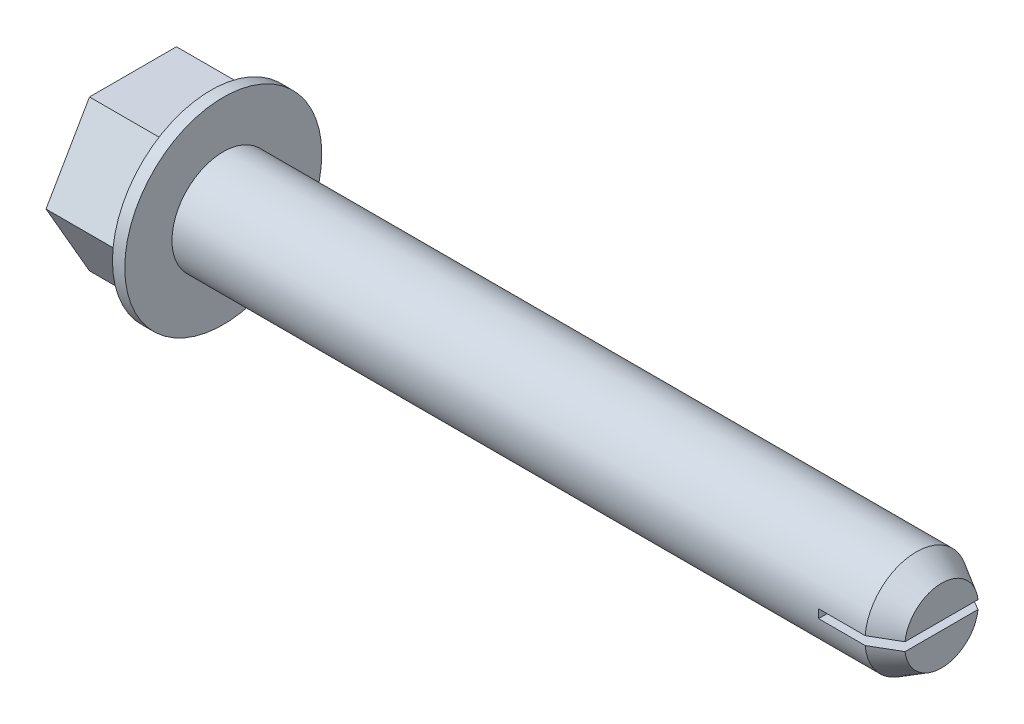
ISO-10303-21;
HEADER;
FILE_DESCRIPTION(('STEP AP214'),'2;1');
FILE_NAME('part.step','',(''),(''),'','','');
FILE_SCHEMA(('AUTOMOTIVE_DESIGN { 1 0 10303 214 1 1 1 1 }'));
ENDSEC;
DATA;
#1=APPLICATION_CONTEXT('core data for automotive mechanical design processes');
#2=APPLICATION_PROTOCOL_DEFINITION('international standard','automotive_design',2000,#1);
#3=PRODUCT_CONTEXT('',#1,'mechanical');
#4=PRODUCT('Part','Part','',(#3));
#5=PRODUCT_RELATED_PRODUCT_CATEGORY('part','',(#4));
#6=PRODUCT_DEFINITION_FORMATION('','',#4);
#7=PRODUCT_DEFINITION_CONTEXT('part definition',#1,'design');
#8=PRODUCT_DEFINITION('design','',#6,#7);
#9=PRODUCT_DEFINITION_SHAPE('','',#8);
#10=(LENGTH_UNIT() NAMED_UNIT(*) SI_UNIT(.MILLI.,.METRE.));
#11=(NAMED_UNIT(*) PLANE_ANGLE_UNIT() SI_UNIT($,.RADIAN.));
#12=(NAMED_UNIT(*) SI_UNIT($,.STERADIAN.) SOLID_ANGLE_UNIT());
#13=UNCERTAINTY_MEASURE_WITH_UNIT(LENGTH_MEASURE(1.E-05),#10,'distance_accuracy_value','');
#14=(GEOMETRIC_REPRESENTATION_CONTEXT(3) GLOBAL_UNCERTAINTY_ASSIGNED_CONTEXT((#13)) GLOBAL_UNIT_ASSIGNED_CONTEXT((#10,
#11,#12)) REPRESENTATION_CONTEXT('',''));
#15=CARTESIAN_POINT('',(0.,0.,0.));
#16=DIRECTION('',(0.,0.,1.));
#17=DIRECTION('',(1.,0.,0.));
#18=AXIS2_PLACEMENT_3D('',#15,#16,#17);
#19=CARTESIAN_POINT('',(-4.6228,3.72872,0.));
#20=DIRECTION('',(1.,0.,0.));
#21=DIRECTION('',(0.,0.,-1.));
#22=AXIS2_PLACEMENT_3D('',#19,#20,#21);
#23=PLANE('',#22);
#24=CARTESIAN_POINT('',(-4.6228,0.,0.));
#25=DIRECTION('',(-1.,0.,0.));
#26=DIRECTION('',(0.,0.,1.));
#27=AXIS2_PLACEMENT_3D('',#24,#25,#26);
#28=CIRCLE('',#27,3.72872);
#29=CARTESIAN_POINT('',(-4.6228,0.,3.72872));
#30=VERTEX_POINT('',#29);
#31=EDGE_CURVE('E20',#30,#30,#28,.T.);
#32=ORIENTED_EDGE('',*,*,#31,.T.);
#33=EDGE_LOOP('',(#32));
#34=FACE_BOUND('',#33,.T.);
#35=ADVANCED_FACE('F17',(#34),#23,.F.);
#36=CARTESIAN_POINT('',(0.,0.,0.));
#37=DIRECTION('',(-1.,0.,0.));
#38=DIRECTION('',(0.,0.,1.));
#39=AXIS2_PLACEMENT_3D('',#36,#37,#38);
#40=CYLINDRICAL_SURFACE('',#39,3.72872);
#41=ORIENTED_EDGE('',*,*,#31,.F.);
#42=EDGE_LOOP('',(#41));
#43=FACE_BOUND('',#42,.T.);
#44=CARTESIAN_POINT('',(-5.588,0.,0.));
#45=DIRECTION('',(-1.,0.,0.));
#46=DIRECTION('',(0.,0.,1.));
#47=AXIS2_PLACEMENT_3D('',#44,#45,#46);
#48=CIRCLE('',#47,3.72872);
#49=CARTESIAN_POINT('',(-5.588,0.,3.72872));
#50=VERTEX_POINT('',#49);
#51=EDGE_CURVE('E125',#50,#50,#48,.T.);
#52=ORIENTED_EDGE('',*,*,#51,.T.);
#53=EDGE_LOOP('',(#52));
#54=FACE_BOUND('',#53,.T.);
#55=ADVANCED_FACE('F212',(#43,#54),#40,.F.);
#56=CARTESIAN_POINT('',(-5.588,4.6609,0.));
#57=DIRECTION('',(1.,0.,0.));
#58=DIRECTION('',(0.,0.,-1.));
#59=AXIS2_PLACEMENT_3D('',#56,#57,#58);
#60=PLANE('',#59);
#61=DIRECTION('',(0.,0.,-1.));
#62=VECTOR('',#61,1.);
#63=CARTESIAN_POINT('',(-5.58799999998882,-4.6609,0.));
#64=LINE('',#63,#62);
#65=CARTESIAN_POINT('',(-5.58800000007968,-4.6609,2.69097186966593));
#66=VERTEX_POINT('',#65);
#67=CARTESIAN_POINT('',(-5.58799999999441,-4.6609,-2.69097186966593));
#68=VERTEX_POINT('',#67);
#69=EDGE_CURVE('E122',#66,#68,#64,.T.);
#70=ORIENTED_EDGE('',*,*,#69,.F.);
#71=DIRECTION('',(0.,-0.866025403784439,-0.5));
#72=VECTOR('',#71,1.);
#73=CARTESIAN_POINT('',(-5.5880000002162,-2.33045,4.03645780449889));
#74=LINE('',#73,#72);
#75=CARTESIAN_POINT('',(-5.58800000007968,0.,5.38194373933185));
#76=VERTEX_POINT('',#75);
#77=EDGE_CURVE('E117',#76,#66,#74,.T.);
#78=ORIENTED_EDGE('',*,*,#77,.F.);
#79=DIRECTION('',(0.,-0.866025403784439,0.5));
#80=VECTOR('',#79,1.);
#81=CARTESIAN_POINT('',(-5.58799999998882,2.33045,4.03645780449889));
#82=LINE('',#81,#80);
#83=CARTESIAN_POINT('',(-5.58799999999441,4.6609,2.69097186966593));
#84=VERTEX_POINT('',#83);
#85=EDGE_CURVE('E114',#84,#76,#82,.T.);
#86=ORIENTED_EDGE('',*,*,#85,.F.);
#87=DIRECTION('',(0.,0.,1.));
#88=VECTOR('',#87,1.);
#89=CARTESIAN_POINT('',(-5.58799999998882,4.6609,0.));
#90=LINE('',#89,#88);
#91=CARTESIAN_POINT('',(-5.58800000007968,4.6609,-2.69097186966593));
#92=VERTEX_POINT('',#91);
#93=EDGE_CURVE('E134',#92,#84,#90,.T.);
#94=ORIENTED_EDGE('',*,*,#93,.F.);
#95=DIRECTION('',(0.,0.866025403784439,0.5));
#96=VECTOR('',#95,1.);
#97=CARTESIAN_POINT('',(-5.5880000002162,2.33045,-4.03645780449889));
#98=LINE('',#97,#96);
#99=CARTESIAN_POINT('',(-5.58800000016215,0.,-5.38194373933185));
#100=VERTEX_POINT('',#99);
#101=EDGE_CURVE('E280',#100,#92,#98,.T.);
#102=ORIENTED_EDGE('',*,*,#101,.F.);
#103=DIRECTION('',(0.,0.866025403784439,-0.5));
#104=VECTOR('',#103,1.);
#105=CARTESIAN_POINT('',(-5.58799999998882,-2.33045,-4.03645780449889));
#106=LINE('',#105,#104);
#107=EDGE_CURVE('E272',#68,#100,#106,.T.);
#108=ORIENTED_EDGE('',*,*,#107,.F.);
#109=EDGE_LOOP('',(#70,#78,#86,#94,#102,#108));
#110=FACE_BOUND('',#109,.T.);
#111=ORIENTED_EDGE('',*,*,#51,.F.);
#112=EDGE_LOOP('',(#111));
#113=FACE_BOUND('',#112,.T.);
#114=ADVANCED_FACE('F119',(#110,#113),#60,.F.);
#115=CARTESIAN_POINT('',(500000.,-2.33045,4.03645780449889));
#116=DIRECTION('',(0.,-0.5,0.866025403784439));
#117=DIRECTION('',(0.,-0.866025403784439,-0.5));
#118=AXIS2_PLACEMENT_3D('',#115,#116,#117);
#119=PLANE('',#118);
#120=DIRECTION('',(0.,0.866025403784439,0.5));
#121=VECTOR('',#120,1.);
#122=CARTESIAN_POINT('',(-0.762,-4.6609,2.69097186966593));
#123=LINE('',#122,#121);
#124=CARTESIAN_POINT('',(-0.762000000091873,-4.6609,2.69097186966593));
#125=VERTEX_POINT('',#124);
#126=CARTESIAN_POINT('',(-0.762000000177139,0.,5.38194373933185));
#127=VERTEX_POINT('',#126);
#128=EDGE_CURVE('E131',#125,#127,#123,.T.);
#129=ORIENTED_EDGE('',*,*,#128,.T.);
#130=DIRECTION('',(1.,0.,0.));
#131=VECTOR('',#130,1.);
#132=CARTESIAN_POINT('',(500000.,0.,5.38194373933185));
#133=LINE('',#132,#131);
#134=EDGE_CURVE('E128',#76,#127,#133,.T.);
#135=ORIENTED_EDGE('',*,*,#134,.F.);
#136=ORIENTED_EDGE('',*,*,#77,.T.);
#137=DIRECTION('',(1.,0.,0.));
#138=VECTOR('',#137,1.);
#139=CARTESIAN_POINT('',(500000.,-4.6609,2.69097186966593));
#140=LINE('',#139,#138);
#141=EDGE_CURVE('E267',#125,#66,#140,.F.);
#142=ORIENTED_EDGE('',*,*,#141,.F.);
#143=EDGE_LOOP('',(#129,#135,#136,#142));
#144=FACE_BOUND('',#143,.T.);
#145=ADVANCED_FACE('F129',(#144),#119,.T.);
#146=CARTESIAN_POINT('',(500000.,2.33045,4.03645780449889));
#147=DIRECTION('',(0.,0.5,0.866025403784439));
#148=DIRECTION('',(0.,-0.866025403784439,0.5));
#149=AXIS2_PLACEMENT_3D('',#146,#147,#148);
#150=PLANE('',#149);
#151=DIRECTION('',(0.,0.866025403784439,-0.5));
#152=VECTOR('',#151,1.);
#153=CARTESIAN_POINT('',(-0.762,0.,5.38194373933185));
#154=LINE('',#153,#152);
#155=CARTESIAN_POINT('',(-0.762000000006608,4.6609,2.69097186966593));
#156=VERTEX_POINT('',#155);
#157=EDGE_CURVE('E264',#127,#156,#154,.T.);
#158=ORIENTED_EDGE('',*,*,#157,.T.);
#159=DIRECTION('',(1.,0.,0.));
#160=VECTOR('',#159,1.);
#161=CARTESIAN_POINT('',(500000.,4.6609,2.69097186966593));
#162=LINE('',#161,#160);
#163=EDGE_CURVE('E138',#84,#156,#162,.T.);
#164=ORIENTED_EDGE('',*,*,#163,.F.);
#165=ORIENTED_EDGE('',*,*,#85,.T.);
#166=ORIENTED_EDGE('',*,*,#134,.T.);
#167=EDGE_LOOP('',(#158,#164,#165,#166));
#168=FACE_BOUND('',#167,.T.);
#169=ADVANCED_FACE('F136',(#168),#150,.T.);
#170=CARTESIAN_POINT('',(500000.,4.6609,0.));
#171=DIRECTION('',(0.,1.,0.));
#172=DIRECTION('',(0.,0.,1.));
#173=AXIS2_PLACEMENT_3D('',#170,#171,#172);
#174=PLANE('',#173);
#175=DIRECTION('',(0.,0.,-1.));
#176=VECTOR('',#175,1.);
#177=CARTESIAN_POINT('',(-0.762,4.6609,0.));
#178=LINE('',#177,#176);
#179=CARTESIAN_POINT('',(-0.762000000049241,4.6609,-2.69097186966593));
#180=VERTEX_POINT('',#179);
#181=EDGE_CURVE('E262',#156,#180,#178,.T.);
#182=ORIENTED_EDGE('',*,*,#181,.T.);
#183=DIRECTION('',(1.,0.,0.));
#184=VECTOR('',#183,1.);
#185=CARTESIAN_POINT('',(500000.,4.6609,-2.69097186966593));
#186=LINE('',#185,#184);
#187=EDGE_CURVE('E277',#92,#180,#186,.T.);
#188=ORIENTED_EDGE('',*,*,#187,.F.);
#189=ORIENTED_EDGE('',*,*,#93,.T.);
#190=ORIENTED_EDGE('',*,*,#163,.T.);
#191=EDGE_LOOP('',(#182,#188,#189,#190));
#192=FACE_BOUND('',#191,.T.);
#193=ADVANCED_FACE('F285',(#192),#174,.T.);
#194=CARTESIAN_POINT('',(500000.,2.33045,-4.03645780449889));
#195=DIRECTION('',(0.,0.5,-0.866025403784439));
#196=DIRECTION('',(0.,0.866025403784439,0.5));
#197=AXIS2_PLACEMENT_3D('',#194,#195,#196);
#198=PLANE('',#197);
#199=DIRECTION('',(0.,-0.866025403784439,-0.5));
#200=VECTOR('',#199,1.);
#201=CARTESIAN_POINT('',(-0.762,4.6609,-2.69097186966593));
#202=LINE('',#201,#200);
#203=CARTESIAN_POINT('',(-0.762000000148717,0.,-5.38194373933185));
#204=VERTEX_POINT('',#203);
#205=EDGE_CURVE('E260',#180,#204,#202,.T.);
#206=ORIENTED_EDGE('',*,*,#205,.T.);
#207=DIRECTION('',(1.,0.,0.));
#208=VECTOR('',#207,1.);
#209=CARTESIAN_POINT('',(500000.,0.,-5.38194373933185));
#210=LINE('',#209,#208);
#211=EDGE_CURVE('E275',#100,#204,#210,.T.);
#212=ORIENTED_EDGE('',*,*,#211,.F.);
#213=ORIENTED_EDGE('',*,*,#101,.T.);
#214=ORIENTED_EDGE('',*,*,#187,.T.);
#215=EDGE_LOOP('',(#206,#212,#213,#214));
#216=FACE_BOUND('',#215,.T.);
#217=ADVANCED_FACE('F289',(#216),#198,.T.);
#218=CARTESIAN_POINT('',(500000.,-2.33045,-4.03645780449889));
#219=DIRECTION('',(0.,-0.5,-0.866025403784439));
#220=DIRECTION('',(0.,0.866025403784439,-0.5));
#221=AXIS2_PLACEMENT_3D('',#218,#219,#220);
#222=PLANE('',#221);
#223=DIRECTION('',(1.,0.,0.));
#224=VECTOR('',#223,1.);
#225=CARTESIAN_POINT('',(500000.,-4.6609,-2.69097186966593));
#226=LINE('',#225,#224);
#227=CARTESIAN_POINT('',(-0.761999999949765,-4.6609,-2.69097186966593));
#228=VERTEX_POINT('',#227);
#229=EDGE_CURVE('E269',#68,#228,#226,.T.);
#230=ORIENTED_EDGE('',*,*,#229,.F.);
#231=ORIENTED_EDGE('',*,*,#107,.T.);
#232=ORIENTED_EDGE('',*,*,#211,.T.);
#233=DIRECTION('',(0.,-0.866025403784439,0.5));
#234=VECTOR('',#233,1.);
#235=CARTESIAN_POINT('',(-0.762,0.,-5.38194373933185));
#236=LINE('',#235,#234);
#237=EDGE_CURVE('E81',#204,#228,#236,.T.);
#238=ORIENTED_EDGE('',*,*,#237,.T.);
#239=EDGE_LOOP('',(#230,#231,#232,#238));
#240=FACE_BOUND('',#239,.T.);
#241=ADVANCED_FACE('F291',(#240),#222,.T.);
#242=CARTESIAN_POINT('',(500000.,-4.6609,0.));
#243=DIRECTION('',(0.,-1.,0.));
#244=DIRECTION('',(0.,0.,-1.));
#245=AXIS2_PLACEMENT_3D('',#242,#243,#244);
#246=PLANE('',#245);
#247=DIRECTION('',(0.,0.,-1.));
#248=VECTOR('',#247,1.);
#249=CARTESIAN_POINT('',(-0.762,-4.6609,0.));
#250=LINE('',#249,#248);
#251=EDGE_CURVE('E204',#228,#125,#250,.F.);
#252=ORIENTED_EDGE('',*,*,#251,.T.);
#253=ORIENTED_EDGE('',*,*,#141,.T.);
#254=ORIENTED_EDGE('',*,*,#69,.T.);
#255=ORIENTED_EDGE('',*,*,#229,.T.);
#256=EDGE_LOOP('',(#252,#253,#254,#255));
#257=FACE_BOUND('',#256,.T.);
#258=ADVANCED_FACE('F294',(#257),#246,.T.);
#259=CARTESIAN_POINT('',(-0.762,6.096,0.));
#260=DIRECTION('',(1.,0.,0.));
#261=DIRECTION('',(0.,0.,-1.));
#262=AXIS2_PLACEMENT_3D('',#259,#260,#261);
#263=PLANE('',#262);
#264=CARTESIAN_POINT('',(-0.762,0.,0.));
#265=DIRECTION('',(-1.,0.,0.));
#266=DIRECTION('',(0.,0.,1.));
#267=AXIS2_PLACEMENT_3D('',#264,#265,#266);
#268=CIRCLE('',#267,6.096);
#269=CARTESIAN_POINT('',(-0.762,0.,6.096));
#270=VERTEX_POINT('',#269);
#271=EDGE_CURVE('E202',#270,#270,#268,.F.);
#272=ORIENTED_EDGE('',*,*,#271,.F.);
#273=EDGE_LOOP('',(#272));
#274=FACE_BOUND('',#273,.T.);
#275=ORIENTED_EDGE('',*,*,#237,.F.);
#276=ORIENTED_EDGE('',*,*,#205,.F.);
#277=ORIENTED_EDGE('',*,*,#181,.F.);
#278=ORIENTED_EDGE('',*,*,#157,.F.);
#279=ORIENTED_EDGE('',*,*,#128,.F.);
#280=ORIENTED_EDGE('',*,*,#251,.F.);
#281=EDGE_LOOP('',(#275,#276,#277,#278,#279,#280));
#282=FACE_BOUND('',#281,.T.);
#283=ADVANCED_FACE('F296',(#274,#282),#263,.F.);
#284=CARTESIAN_POINT('',(44.45,3.175,0.));
#285=DIRECTION('',(-1.,0.,0.));
#286=DIRECTION('',(0.,0.,1.));
#287=AXIS2_PLACEMENT_3D('',#284,#285,#286);
#288=PLANE('',#287);
#289=DIRECTION('',(0.,0.,-1.));
#290=VECTOR('',#289,1.);
#291=CARTESIAN_POINT('',(44.45,-0.264583333333333,-6.096));
#292=LINE('',#291,#290);
#293=CARTESIAN_POINT('',(44.449999999988,-0.264583333333333,-2.25785042677769));
#294=VERTEX_POINT('',#293);
#295=CARTESIAN_POINT('',(44.4499999999917,-0.264583333333333,2.25785042677553));
#296=VERTEX_POINT('',#295);
#297=EDGE_CURVE('E200',#294,#296,#292,.F.);
#298=ORIENTED_EDGE('',*,*,#297,.T.);
#299=CARTESIAN_POINT('',(44.4499999999834,0.,0.));
#300=DIRECTION('',(-1.,0.,0.));
#301=DIRECTION('',(0.,0.,1.));
#302=AXIS2_PLACEMENT_3D('',#299,#300,#301);
#303=CIRCLE('',#302,2.27329999999779);
#304=EDGE_CURVE('E72',#294,#296,#303,.T.);
#305=ORIENTED_EDGE('',*,*,#304,.F.);
#306=EDGE_LOOP('',(#298,#305));
#307=FACE_BOUND('',#306,.T.);
#308=ADVANCED_FACE('F298',(#307),#288,.F.);
#309=CARTESIAN_POINT('',(0.,0.,0.));
#310=DIRECTION('',(-1.,0.,0.));
#311=DIRECTION('',(0.,0.,1.));
#312=AXIS2_PLACEMENT_3D('',#309,#310,#311);
#313=CYLINDRICAL_SURFACE('',#312,6.096);
#314=ORIENTED_EDGE('',*,*,#271,.T.);
#315=EDGE_LOOP('',(#314));
#316=FACE_BOUND('',#315,.T.);
#317=CARTESIAN_POINT('',(0.,0.,0.));
#318=DIRECTION('',(-1.,0.,0.));
#319=DIRECTION('',(0.,0.,1.));
#320=AXIS2_PLACEMENT_3D('',#317,#318,#319);
#321=CIRCLE('',#320,6.096);
#322=CARTESIAN_POINT('',(0.,0.,6.096));
#323=VERTEX_POINT('',#322);
#324=EDGE_CURVE('E240',#323,#323,#321,.T.);
#325=ORIENTED_EDGE('',*,*,#324,.T.);
#326=EDGE_LOOP('',(#325));
#327=FACE_BOUND('',#326,.T.);
#328=ADVANCED_FACE('F305',(#316,#327),#313,.T.);
#329=CARTESIAN_POINT('',(42.8882097870087,0.,0.));
#330=DIRECTION('',(-1.,0.,0.));
#331=DIRECTION('',(0.,0.,1.));
#332=AXIS2_PLACEMENT_3D('',#329,#330,#331);
#333=CONICAL_SURFACE('',#332,3.17499999988513,0.523598775602448);
#334=CARTESIAN_POINT('',(42.8882097868138,-0.264583333333333,-3.16395648827657));
#335=CARTESIAN_POINT('',(43.1485950521293,-0.264583333333333,-3.01308870931694));
#336=CARTESIAN_POINT('',(43.4089562454949,-0.264583333333333,-2.86217927279922));
#337=CARTESIAN_POINT('',(43.7994183217424,-0.264583333333333,-2.63567773136921));
#338=CARTESIAN_POINT('',(43.9295590617315,-0.264583333333333,-2.56015431966349));
#339=CARTESIAN_POINT('',(44.1898067189551,-0.264583333333333,-2.40904920793228));
#340=CARTESIAN_POINT('',(44.3199136361855,-0.264583333333333,-2.33346750789945));
#341=CARTESIAN_POINT('',(44.4499999999926,-0.264583333333333,-2.25785042677504));
#342=B_SPLINE_CURVE_WITH_KNOTS('',3,(#334,#335,#336,#337,#338,#339,#340,#341),.UNSPECIFIED.,.F.,
.F.,(4,2,2,4),(0.,0.902803568710737,1.35420535450102,1.8056071970637),.UNSPECIFIED.);
#343=CARTESIAN_POINT('',(42.8882097868144,-0.264583333333333,-3.16395648827774));
#344=VERTEX_POINT('',#343);
#345=EDGE_CURVE('E195',#344,#294,#342,.T.);
#346=ORIENTED_EDGE('',*,*,#345,.T.);
#347=ORIENTED_EDGE('',*,*,#304,.T.);
#348=CARTESIAN_POINT('',(44.449999999992,-0.264583333333333,2.25785042677537));
#349=CARTESIAN_POINT('',(44.3199136361849,-0.264583333333333,2.33346750789974));
#350=CARTESIAN_POINT('',(44.1898067189547,-0.264583333333333,2.40904920793255));
#351=CARTESIAN_POINT('',(43.9295590617311,-0.264583333333333,2.56015431966371));
#352=CARTESIAN_POINT('',(43.7994183217421,-0.264583333333333,2.6356777313694));
#353=CARTESIAN_POINT('',(43.4089562454947,-0.264583333333333,2.86217927279933));
#354=CARTESIAN_POINT('',(43.1485950521292,-0.264583333333333,3.01308870931699));
#355=CARTESIAN_POINT('',(42.8882097868138,-0.264583333333333,3.16395648827657));
#356=B_SPLINE_CURVE_WITH_KNOTS('',3,(#348,#349,#350,#351,#352,#353,#354,#355),.UNSPECIFIED.,.F.,
.F.,(4,2,2,4),(0.,0.451401842562509,0.902803628352632,1.80560719706304),.UNSPECIFIED.);
#357=CARTESIAN_POINT('',(42.8882097868144,-0.264583333333333,3.16395648827774));
#358=VERTEX_POINT('',#357);
#359=EDGE_CURVE('E189',#296,#358,#356,.T.);
#360=ORIENTED_EDGE('',*,*,#359,.T.);
#361=CARTESIAN_POINT('',(42.8882097868151,0.,0.));
#362=DIRECTION('',(-1.,0.,0.));
#363=DIRECTION('',(0.,0.,1.));
#364=AXIS2_PLACEMENT_3D('',#361,#362,#363);
#365=CIRCLE('',#364,3.175);
#366=EDGE_CURVE('E249',#344,#358,#365,.T.);
#367=ORIENTED_EDGE('',*,*,#366,.F.);
#368=EDGE_LOOP('',(#346,#347,#360,#367));
#369=FACE_BOUND('',#368,.T.);
#370=ADVANCED_FACE('F183',(#369),#333,.T.);
#371=CARTESIAN_POINT('',(40.005,-0.264583333333333,-6.096));
#372=DIRECTION('',(0.,-1.,0.));
#373=DIRECTION('',(0.,0.,-1.));
#374=AXIS2_PLACEMENT_3D('',#371,#372,#373);
#375=PLANE('',#374);
#376=ORIENTED_EDGE('',*,*,#297,.F.);
#377=ORIENTED_EDGE('',*,*,#345,.F.);
#378=DIRECTION('',(-1.,0.,0.));
#379=VECTOR('',#378,1.);
#380=CARTESIAN_POINT('',(0.,-0.264583333333333,-3.16395648827891));
#381=LINE('',#380,#379);
#382=CARTESIAN_POINT('',(40.005,-0.264583333333333,-3.16395648827891));
#383=VERTEX_POINT('',#382);
#384=EDGE_CURVE('E252',#383,#344,#381,.F.);
#385=ORIENTED_EDGE('',*,*,#384,.F.);
#386=DIRECTION('',(0.,0.,1.));
#387=VECTOR('',#386,1.);
#388=CARTESIAN_POINT('',(40.005,-0.264583333333333,-6.096));
#389=LINE('',#388,#387);
#390=CARTESIAN_POINT('',(40.005,-0.264583333333333,3.16395648827891));
#391=VERTEX_POINT('',#390);
#392=EDGE_CURVE('E238',#383,#391,#389,.T.);
#393=ORIENTED_EDGE('',*,*,#392,.T.);
#394=DIRECTION('',(-1.,0.,0.));
#395=VECTOR('',#394,1.);
#396=CARTESIAN_POINT('',(0.,-0.264583333333333,3.16395648827891));
#397=LINE('',#396,#395);
#398=EDGE_CURVE('E245',#358,#391,#397,.T.);
#399=ORIENTED_EDGE('',*,*,#398,.F.);
#400=ORIENTED_EDGE('',*,*,#359,.F.);
#401=EDGE_LOOP('',(#376,#377,#385,#393,#399,#400));
#402=FACE_BOUND('',#401,.T.);
#403=ADVANCED_FACE('F178',(#402),#375,.F.);
#404=CARTESIAN_POINT('',(40.005,0.264583333333333,-6.096));
#405=DIRECTION('',(-1.,0.,0.));
#406=DIRECTION('',(0.,0.,1.));
#407=AXIS2_PLACEMENT_3D('',#404,#405,#406);
#408=PLANE('',#407);
#409=DIRECTION('',(0.,0.,1.));
#410=VECTOR('',#409,1.);
#411=CARTESIAN_POINT('',(40.005,0.264583333333333,-6.096));
#412=LINE('',#411,#410);
#413=CARTESIAN_POINT('',(40.005,0.264583333333333,-3.16395648827891));
#414=VERTEX_POINT('',#413);
#415=CARTESIAN_POINT('',(40.005,0.264583333333333,3.16395648827891));
#416=VERTEX_POINT('',#415);
#417=EDGE_CURVE('E241',#414,#416,#412,.T.);
#418=ORIENTED_EDGE('',*,*,#417,.T.);
#419=CARTESIAN_POINT('',(40.005,0.,0.));
#420=DIRECTION('',(-1.,0.,0.));
#421=DIRECTION('',(0.,0.,1.));
#422=AXIS2_PLACEMENT_3D('',#419,#420,#421);
#423=CIRCLE('',#422,3.175);
#424=EDGE_CURVE('E248',#391,#416,#423,.T.);
#425=ORIENTED_EDGE('',*,*,#424,.F.);
#426=ORIENTED_EDGE('',*,*,#392,.F.);
#427=CARTESIAN_POINT('',(40.005,0.,0.));
#428=DIRECTION('',(-1.,0.,0.));
#429=DIRECTION('',(0.,0.,1.));
#430=AXIS2_PLACEMENT_3D('',#427,#428,#429);
#431=CIRCLE('',#430,3.175);
#432=EDGE_CURVE('E255',#414,#383,#431,.T.);
#433=ORIENTED_EDGE('',*,*,#432,.F.);
#434=EDGE_LOOP('',(#418,#425,#426,#433));
#435=FACE_BOUND('',#434,.T.);
#436=ADVANCED_FACE('F174',(#435),#408,.F.);
#437=CARTESIAN_POINT('',(44.45,3.175,0.));
#438=DIRECTION('',(-1.,0.,0.));
#439=DIRECTION('',(0.,0.,1.));
#440=AXIS2_PLACEMENT_3D('',#437,#438,#439);
#441=PLANE('',#440);
#442=DIRECTION('',(0.,0.,1.));
#443=VECTOR('',#442,1.);
#444=CARTESIAN_POINT('',(44.45,0.264583333333333,-6.096));
#445=LINE('',#444,#443);
#446=CARTESIAN_POINT('',(44.449999999988,0.264583333333333,2.25785042677769));
#447=VERTEX_POINT('',#446);
#448=CARTESIAN_POINT('',(44.4499999999917,0.264583333333333,-2.25785042677553));
#449=VERTEX_POINT('',#448);
#450=EDGE_CURVE('E153',#447,#449,#445,.F.);
#451=ORIENTED_EDGE('',*,*,#450,.T.);
#452=CARTESIAN_POINT('',(44.4499999999834,0.,0.));
#453=DIRECTION('',(-1.,0.,0.));
#454=DIRECTION('',(0.,0.,1.));
#455=AXIS2_PLACEMENT_3D('',#452,#453,#454);
#456=CIRCLE('',#455,2.27329999999779);
#457=EDGE_CURVE('E244',#447,#449,#456,.T.);
#458=ORIENTED_EDGE('',*,*,#457,.F.);
#459=EDGE_LOOP('',(#451,#458));
#460=FACE_BOUND('',#459,.T.);
#461=ADVANCED_FACE('F170',(#460),#441,.F.);
#462=CARTESIAN_POINT('',(0.,3.175,0.));
#463=DIRECTION('',(-1.,0.,0.));
#464=DIRECTION('',(0.,0.,1.));
#465=AXIS2_PLACEMENT_3D('',#462,#463,#464);
#466=PLANE('',#465);
#467=CARTESIAN_POINT('',(0.,0.,0.));
#468=DIRECTION('',(-1.,0.,0.));
#469=DIRECTION('',(0.,0.,1.));
#470=AXIS2_PLACEMENT_3D('',#467,#468,#469);
#471=CIRCLE('',#470,3.175);
#472=CARTESIAN_POINT('',(0.,0.,3.175));
#473=VERTEX_POINT('',#472);
#474=EDGE_CURVE('E143',#473,#473,#471,.F.);
#475=ORIENTED_EDGE('',*,*,#474,.F.);
#476=EDGE_LOOP('',(#475));
#477=FACE_BOUND('',#476,.T.);
#478=ORIENTED_EDGE('',*,*,#324,.F.);
#479=EDGE_LOOP('',(#478));
#480=FACE_BOUND('',#479,.T.);
#481=ADVANCED_FACE('F166',(#477,#480),#466,.F.);
#482=CARTESIAN_POINT('',(42.8882097870087,0.,0.));
#483=DIRECTION('',(-1.,0.,0.));
#484=DIRECTION('',(0.,0.,1.));
#485=AXIS2_PLACEMENT_3D('',#482,#483,#484);
#486=CONICAL_SURFACE('',#485,3.17499999988513,0.523598775602448);
#487=CARTESIAN_POINT('',(42.8882097868171,0.264583333333333,3.16395648827466));
#488=CARTESIAN_POINT('',(43.1485950521321,0.264583333333333,3.01308870931535));
#489=CARTESIAN_POINT('',(43.4089562454971,0.264583333333333,2.86217927279795));
#490=CARTESIAN_POINT('',(43.7994183217437,0.264583333333333,2.63567773136842));
#491=CARTESIAN_POINT('',(43.9295590617326,0.264583333333333,2.56015431966286));
#492=CARTESIAN_POINT('',(44.1898067189557,0.264583333333333,2.40904920793196));
#493=CARTESIAN_POINT('',(44.3199136361857,0.264583333333333,2.33346750789929));
#494=CARTESIAN_POINT('',(44.4499999999926,0.264583333333333,2.25785042677504));
#495=B_SPLINE_CURVE_WITH_KNOTS('',3,(#487,#488,#489,#490,#491,#492,#493,#494),.UNSPECIFIED.,.F.,
.F.,(4,2,2,4),(0.,0.902803568708829,1.35420535449816,1.80560719705989),.UNSPECIFIED.);
#496=CARTESIAN_POINT('',(42.8882097868161,0.264583333333333,3.16395648827679));
#497=VERTEX_POINT('',#496);
#498=EDGE_CURVE('E154',#497,#447,#495,.T.);
#499=ORIENTED_EDGE('',*,*,#498,.T.);
#500=ORIENTED_EDGE('',*,*,#457,.T.);
#501=CARTESIAN_POINT('',(44.4499999999884,0.264583333333333,-2.25785042677746));
#502=CARTESIAN_POINT('',(44.3199136361822,0.264583333333333,-2.33346750790134));
#503=CARTESIAN_POINT('',(44.1898067189528,0.264583333333333,-2.40904920793365));
#504=CARTESIAN_POINT('',(43.9295590617309,0.264583333333333,-2.56015431966383));
#505=CARTESIAN_POINT('',(43.7994183217427,0.264583333333333,-2.63567773136903));
#506=CARTESIAN_POINT('',(43.4089562454979,0.264583333333333,-2.86217927279748));
#507=CARTESIAN_POINT('',(43.1485950521341,0.264583333333333,-3.01308870931415));
#508=CARTESIAN_POINT('',(42.8882097868204,0.264583333333333,-3.16395648827275));
#509=B_SPLINE_CURVE_WITH_KNOTS('',3,(#501,#502,#503,#504,#505,#506,#507,#508),.UNSPECIFIED.,.F.,
.F.,(4,2,2,4),(0.,0.451401842559563,0.902803628346742,1.80560719705126),.UNSPECIFIED.);
#510=CARTESIAN_POINT('',(42.8882097868177,0.264583333333333,-3.16395648827583));
#511=VERTEX_POINT('',#510);
#512=EDGE_CURVE('E35',#449,#511,#509,.T.);
#513=ORIENTED_EDGE('',*,*,#512,.T.);
#514=CARTESIAN_POINT('',(42.8882097868151,0.,0.));
#515=DIRECTION('',(-1.,0.,0.));
#516=DIRECTION('',(0.,0.,1.));
#517=AXIS2_PLACEMENT_3D('',#514,#515,#516);
#518=CIRCLE('',#517,3.175);
#519=EDGE_CURVE('E26',#497,#511,#518,.T.);
#520=ORIENTED_EDGE('',*,*,#519,.F.);
#521=EDGE_LOOP('',(#499,#500,#513,#520));
#522=FACE_BOUND('',#521,.T.);
#523=ADVANCED_FACE('F162',(#522),#486,.T.);
#524=CARTESIAN_POINT('',(40.005,0.264583333333333,-6.096));
#525=DIRECTION('',(0.,1.,0.));
#526=DIRECTION('',(0.,0.,1.));
#527=AXIS2_PLACEMENT_3D('',#524,#525,#526);
#528=PLANE('',#527);
#529=ORIENTED_EDGE('',*,*,#450,.F.);
#530=ORIENTED_EDGE('',*,*,#498,.F.);
#531=DIRECTION('',(-1.,0.,0.));
#532=VECTOR('',#531,1.);
#533=CARTESIAN_POINT('',(0.,0.264583333333334,3.16395648827891));
#534=LINE('',#533,#532);
#535=EDGE_CURVE('E146',#416,#497,#534,.F.);
#536=ORIENTED_EDGE('',*,*,#535,.F.);
#537=ORIENTED_EDGE('',*,*,#417,.F.);
#538=DIRECTION('',(-1.,0.,0.));
#539=VECTOR('',#538,1.);
#540=CARTESIAN_POINT('',(0.,0.264583333333334,-3.16395648827891));
#541=LINE('',#540,#539);
#542=EDGE_CURVE('E11',#511,#414,#541,.T.);
#543=ORIENTED_EDGE('',*,*,#542,.F.);
#544=ORIENTED_EDGE('',*,*,#512,.F.);
#545=EDGE_LOOP('',(#529,#530,#536,#537,#543,#544));
#546=FACE_BOUND('',#545,.T.);
#547=ADVANCED_FACE('F159',(#546),#528,.F.);
#548=CARTESIAN_POINT('',(0.,0.,0.));
#549=DIRECTION('',(-1.,0.,0.));
#550=DIRECTION('',(0.,0.,1.));
#551=AXIS2_PLACEMENT_3D('',#548,#549,#550);
#552=CYLINDRICAL_SURFACE('',#551,3.175);
#553=ORIENTED_EDGE('',*,*,#474,.T.);
#554=EDGE_LOOP('',(#553));
#555=FACE_BOUND('',#554,.T.);
#556=ORIENTED_EDGE('',*,*,#519,.T.);
#557=ORIENTED_EDGE('',*,*,#542,.T.);
#558=ORIENTED_EDGE('',*,*,#432,.T.);
#559=ORIENTED_EDGE('',*,*,#384,.T.);
#560=ORIENTED_EDGE('',*,*,#366,.T.);
#561=ORIENTED_EDGE('',*,*,#398,.T.);
#562=ORIENTED_EDGE('',*,*,#424,.T.);
#563=ORIENTED_EDGE('',*,*,#535,.T.);
#564=EDGE_LOOP('',(#556,#557,#558,#559,#560,#561,#562,#563));
#565=FACE_BOUND('',#564,.T.);
#566=ADVANCED_FACE('F220',(#555,#565),#552,.T.);
#567=CLOSED_SHELL('',(#35,#55,#114,#145,#169,#193,#217,#241,#258,#283,#308,#328,#370,#403,#436,
#461,#481,#523,#547,#566));
#568=MANIFOLD_SOLID_BREP('B1',#567);
#569=ADVANCED_BREP_SHAPE_REPRESENTATION('',(#18,#568),#14);
#570=SHAPE_DEFINITION_REPRESENTATION(#9,#569);
ENDSEC;
END-ISO-10303-21;
